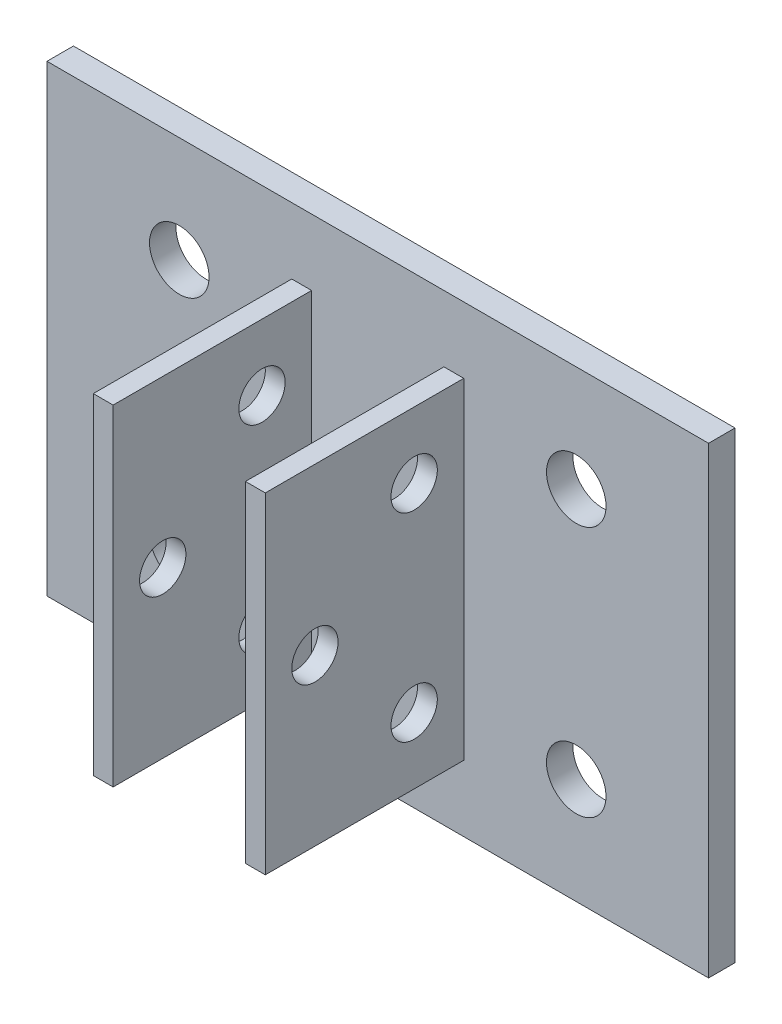
ISO-10303-21;
HEADER;
FILE_DESCRIPTION(('STEP AP214'),'2;1');
FILE_NAME('part.step','',(''),(''),'','','');
FILE_SCHEMA(('AUTOMOTIVE_DESIGN { 1 0 10303 214 1 1 1 1 }'));
ENDSEC;
DATA;
#1=APPLICATION_CONTEXT('core data for automotive mechanical design processes');
#2=APPLICATION_PROTOCOL_DEFINITION('international standard','automotive_design',2000,#1);
#3=PRODUCT_CONTEXT('',#1,'mechanical');
#4=PRODUCT('Part','Part','',(#3));
#5=PRODUCT_RELATED_PRODUCT_CATEGORY('part','',(#4));
#6=PRODUCT_DEFINITION_FORMATION('','',#4);
#7=PRODUCT_DEFINITION_CONTEXT('part definition',#1,'design');
#8=PRODUCT_DEFINITION('design','',#6,#7);
#9=PRODUCT_DEFINITION_SHAPE('','',#8);
#10=(LENGTH_UNIT() NAMED_UNIT(*) SI_UNIT(.MILLI.,.METRE.));
#11=(NAMED_UNIT(*) PLANE_ANGLE_UNIT() SI_UNIT($,.RADIAN.));
#12=(NAMED_UNIT(*) SI_UNIT($,.STERADIAN.) SOLID_ANGLE_UNIT());
#13=UNCERTAINTY_MEASURE_WITH_UNIT(LENGTH_MEASURE(1.E-05),#10,'distance_accuracy_value','');
#14=(GEOMETRIC_REPRESENTATION_CONTEXT(3) GLOBAL_UNCERTAINTY_ASSIGNED_CONTEXT((#13)) GLOBAL_UNIT_ASSIGNED_CONTEXT((#10,
#11,#12)) REPRESENTATION_CONTEXT('',''));
#15=CARTESIAN_POINT('',(0.,0.,0.));
#16=DIRECTION('',(0.,0.,1.));
#17=DIRECTION('',(1.,0.,0.));
#18=AXIS2_PLACEMENT_3D('',#15,#16,#17);
#19=CARTESIAN_POINT('',(0.,0.,2.));
#20=DIRECTION('',(0.,0.,-1.));
#21=DIRECTION('',(-1.,0.,0.));
#22=AXIS2_PLACEMENT_3D('',#19,#20,#21);
#23=PLANE('',#22);
#24=CARTESIAN_POINT('',(15.,-9.5,2.));
#25=DIRECTION('',(0.,0.,1.));
#26=DIRECTION('',(-1.,0.,0.));
#27=AXIS2_PLACEMENT_3D('',#24,#25,#26);
#28=CIRCLE('',#27,2.25);
#29=CARTESIAN_POINT('',(12.75,-9.5,2.));
#30=VERTEX_POINT('',#29);
#31=EDGE_CURVE('E188',#30,#30,#28,.T.);
#32=ORIENTED_EDGE('',*,*,#31,.F.);
#33=EDGE_LOOP('',(#32));
#34=FACE_BOUND('',#33,.T.);
#35=CARTESIAN_POINT('',(-15.,-9.5,2.));
#36=DIRECTION('',(0.,0.,1.));
#37=DIRECTION('',(1.,0.,0.));
#38=AXIS2_PLACEMENT_3D('',#35,#36,#37);
#39=CIRCLE('',#38,2.25);
#40=CARTESIAN_POINT('',(-12.75,-9.5,2.));
#41=VERTEX_POINT('',#40);
#42=EDGE_CURVE('E194',#41,#41,#39,.T.);
#43=ORIENTED_EDGE('',*,*,#42,.F.);
#44=EDGE_LOOP('',(#43));
#45=FACE_BOUND('',#44,.T.);
#46=CARTESIAN_POINT('',(-15.,9.5,2.));
#47=DIRECTION('',(0.,0.,1.));
#48=DIRECTION('',(-1.,0.,0.));
#49=AXIS2_PLACEMENT_3D('',#46,#47,#48);
#50=CIRCLE('',#49,2.25);
#51=CARTESIAN_POINT('',(-17.25,9.5,2.));
#52=VERTEX_POINT('',#51);
#53=EDGE_CURVE('E200',#52,#52,#50,.T.);
#54=ORIENTED_EDGE('',*,*,#53,.F.);
#55=EDGE_LOOP('',(#54));
#56=FACE_BOUND('',#55,.T.);
#57=CARTESIAN_POINT('',(15.,9.5,2.));
#58=DIRECTION('',(0.,0.,1.));
#59=DIRECTION('',(1.,0.,0.));
#60=AXIS2_PLACEMENT_3D('',#57,#58,#59);
#61=CIRCLE('',#60,2.25);
#62=CARTESIAN_POINT('',(17.25,9.5,2.));
#63=VERTEX_POINT('',#62);
#64=EDGE_CURVE('E206',#63,#63,#61,.T.);
#65=ORIENTED_EDGE('',*,*,#64,.F.);
#66=EDGE_LOOP('',(#65));
#67=FACE_BOUND('',#66,.T.);
#68=DIRECTION('',(0.,1.,0.));
#69=VECTOR('',#68,1.);
#70=CARTESIAN_POINT('',(25.,-17.5,2.));
#71=LINE('',#70,#69);
#72=CARTESIAN_POINT('',(25.,-17.5,2.));
#73=VERTEX_POINT('',#72);
#74=CARTESIAN_POINT('',(25.,17.5,2.));
#75=VERTEX_POINT('',#74);
#76=EDGE_CURVE('E212',#73,#75,#71,.T.);
#77=ORIENTED_EDGE('',*,*,#76,.T.);
#78=DIRECTION('',(-1.,0.,0.));
#79=VECTOR('',#78,1.);
#80=CARTESIAN_POINT('',(-25.,17.5,2.));
#81=LINE('',#80,#79);
#82=CARTESIAN_POINT('',(-25.,17.5,2.));
#83=VERTEX_POINT('',#82);
#84=EDGE_CURVE('E215',#75,#83,#81,.T.);
#85=ORIENTED_EDGE('',*,*,#84,.T.);
#86=DIRECTION('',(0.,-1.,0.));
#87=VECTOR('',#86,1.);
#88=CARTESIAN_POINT('',(-25.,-17.5,2.));
#89=LINE('',#88,#87);
#90=CARTESIAN_POINT('',(-25.,-17.5,2.));
#91=VERTEX_POINT('',#90);
#92=EDGE_CURVE('E218',#83,#91,#89,.T.);
#93=ORIENTED_EDGE('',*,*,#92,.T.);
#94=DIRECTION('',(1.,0.,0.));
#95=VECTOR('',#94,1.);
#96=CARTESIAN_POINT('',(-25.,-17.5,2.));
#97=LINE('',#96,#95);
#98=EDGE_CURVE('E220',#91,#73,#97,.T.);
#99=ORIENTED_EDGE('',*,*,#98,.T.);
#100=EDGE_LOOP('',(#77,#85,#93,#99));
#101=FACE_BOUND('',#100,.T.);
#102=DIRECTION('',(1.,0.,0.));
#103=VECTOR('',#102,1.);
#104=CARTESIAN_POINT('',(0.,12.5,2.));
#105=LINE('',#104,#103);
#106=CARTESIAN_POINT('',(-6.5,12.5,2.));
#107=VERTEX_POINT('',#106);
#108=CARTESIAN_POINT('',(-5.,12.5,2.));
#109=VERTEX_POINT('',#108);
#110=EDGE_CURVE('E152',#107,#109,#105,.T.);
#111=ORIENTED_EDGE('',*,*,#110,.T.);
#112=DIRECTION('',(0.,-1.,0.));
#113=VECTOR('',#112,1.);
#114=CARTESIAN_POINT('',(-5.,0.,2.));
#115=LINE('',#114,#113);
#116=CARTESIAN_POINT('',(-5.,-12.5,2.));
#117=VERTEX_POINT('',#116);
#118=EDGE_CURVE('E150',#109,#117,#115,.T.);
#119=ORIENTED_EDGE('',*,*,#118,.T.);
#120=DIRECTION('',(1.,0.,0.));
#121=VECTOR('',#120,1.);
#122=CARTESIAN_POINT('',(0.,-12.5,2.));
#123=LINE('',#122,#121);
#124=CARTESIAN_POINT('',(-6.5,-12.5,2.));
#125=VERTEX_POINT('',#124);
#126=EDGE_CURVE('E162',#125,#117,#123,.T.);
#127=ORIENTED_EDGE('',*,*,#126,.F.);
#128=DIRECTION('',(0.,1.,0.));
#129=VECTOR('',#128,1.);
#130=CARTESIAN_POINT('',(-6.5,0.,2.));
#131=LINE('',#130,#129);
#132=EDGE_CURVE('E172',#125,#107,#131,.T.);
#133=ORIENTED_EDGE('',*,*,#132,.T.);
#134=EDGE_LOOP('',(#111,#119,#127,#133));
#135=FACE_BOUND('',#134,.T.);
#136=DIRECTION('',(1.,0.,0.));
#137=VECTOR('',#136,1.);
#138=CARTESIAN_POINT('',(0.,-12.5,2.));
#139=LINE('',#138,#137);
#140=CARTESIAN_POINT('',(5.,-12.5,2.));
#141=VERTEX_POINT('',#140);
#142=CARTESIAN_POINT('',(6.5,-12.5,2.));
#143=VERTEX_POINT('',#142);
#144=EDGE_CURVE('E149',#141,#143,#139,.T.);
#145=ORIENTED_EDGE('',*,*,#144,.F.);
#146=DIRECTION('',(0.,-1.,0.));
#147=VECTOR('',#146,1.);
#148=CARTESIAN_POINT('',(5.,0.,2.));
#149=LINE('',#148,#147);
#150=CARTESIAN_POINT('',(5.,12.5,2.));
#151=VERTEX_POINT('',#150);
#152=EDGE_CURVE('E146',#151,#141,#149,.T.);
#153=ORIENTED_EDGE('',*,*,#152,.F.);
#154=DIRECTION('',(1.,0.,0.));
#155=VECTOR('',#154,1.);
#156=CARTESIAN_POINT('',(0.,12.5,2.));
#157=LINE('',#156,#155);
#158=CARTESIAN_POINT('',(6.5,12.5,2.));
#159=VERTEX_POINT('',#158);
#160=EDGE_CURVE('E59',#151,#159,#157,.T.);
#161=ORIENTED_EDGE('',*,*,#160,.T.);
#162=DIRECTION('',(0.,1.,0.));
#163=VECTOR('',#162,1.);
#164=CARTESIAN_POINT('',(6.5,0.,2.));
#165=LINE('',#164,#163);
#166=EDGE_CURVE('E54',#143,#159,#165,.T.);
#167=ORIENTED_EDGE('',*,*,#166,.F.);
#168=EDGE_LOOP('',(#145,#153,#161,#167));
#169=FACE_BOUND('',#168,.T.);
#170=ADVANCED_FACE('F37',(#34,#45,#56,#67,#101,#135,#169),#23,.F.);
#171=CARTESIAN_POINT('',(0.,0.,0.));
#172=DIRECTION('',(0.,0.,-1.));
#173=DIRECTION('',(-1.,0.,0.));
#174=AXIS2_PLACEMENT_3D('',#171,#172,#173);
#175=PLANE('',#174);
#176=CARTESIAN_POINT('',(-15.,-9.5,0.));
#177=DIRECTION('',(0.,0.,1.));
#178=DIRECTION('',(1.,0.,0.));
#179=AXIS2_PLACEMENT_3D('',#176,#177,#178);
#180=CIRCLE('',#179,2.25);
#181=CARTESIAN_POINT('',(-12.75,-9.5,0.));
#182=VERTEX_POINT('',#181);
#183=EDGE_CURVE('E191',#182,#182,#180,.T.);
#184=ORIENTED_EDGE('',*,*,#183,.T.);
#185=EDGE_LOOP('',(#184));
#186=FACE_BOUND('',#185,.T.);
#187=CARTESIAN_POINT('',(15.,9.5,0.));
#188=DIRECTION('',(0.,0.,1.));
#189=DIRECTION('',(1.,0.,0.));
#190=AXIS2_PLACEMENT_3D('',#187,#188,#189);
#191=CIRCLE('',#190,2.25);
#192=CARTESIAN_POINT('',(17.25,9.5,0.));
#193=VERTEX_POINT('',#192);
#194=EDGE_CURVE('E203',#193,#193,#191,.T.);
#195=ORIENTED_EDGE('',*,*,#194,.T.);
#196=EDGE_LOOP('',(#195));
#197=FACE_BOUND('',#196,.T.);
#198=DIRECTION('',(0.,1.,0.));
#199=VECTOR('',#198,1.);
#200=CARTESIAN_POINT('',(25.,-17.5,0.));
#201=LINE('',#200,#199);
#202=CARTESIAN_POINT('',(25.,-17.5,0.));
#203=VERTEX_POINT('',#202);
#204=CARTESIAN_POINT('',(25.,17.5,0.));
#205=VERTEX_POINT('',#204);
#206=EDGE_CURVE('E209',#203,#205,#201,.T.);
#207=ORIENTED_EDGE('',*,*,#206,.F.);
#208=DIRECTION('',(1.,0.,0.));
#209=VECTOR('',#208,1.);
#210=CARTESIAN_POINT('',(-25.,-17.5,0.));
#211=LINE('',#210,#209);
#212=CARTESIAN_POINT('',(-25.,-17.5,0.));
#213=VERTEX_POINT('',#212);
#214=EDGE_CURVE('E216',#213,#203,#211,.T.);
#215=ORIENTED_EDGE('',*,*,#214,.F.);
#216=DIRECTION('',(0.,-1.,0.));
#217=VECTOR('',#216,1.);
#218=CARTESIAN_POINT('',(-25.,-17.5,0.));
#219=LINE('',#218,#217);
#220=CARTESIAN_POINT('',(-25.,17.5,0.));
#221=VERTEX_POINT('',#220);
#222=EDGE_CURVE('E227',#221,#213,#219,.T.);
#223=ORIENTED_EDGE('',*,*,#222,.F.);
#224=DIRECTION('',(-1.,0.,0.));
#225=VECTOR('',#224,1.);
#226=CARTESIAN_POINT('',(-25.,17.5,0.));
#227=LINE('',#226,#225);
#228=EDGE_CURVE('E225',#205,#221,#227,.T.);
#229=ORIENTED_EDGE('',*,*,#228,.F.);
#230=EDGE_LOOP('',(#207,#215,#223,#229));
#231=FACE_BOUND('',#230,.T.);
#232=CARTESIAN_POINT('',(-15.,9.5,0.));
#233=DIRECTION('',(0.,0.,1.));
#234=DIRECTION('',(-1.,0.,0.));
#235=AXIS2_PLACEMENT_3D('',#232,#233,#234);
#236=CIRCLE('',#235,2.25);
#237=CARTESIAN_POINT('',(-17.25,9.5,0.));
#238=VERTEX_POINT('',#237);
#239=EDGE_CURVE('E197',#238,#238,#236,.T.);
#240=ORIENTED_EDGE('',*,*,#239,.T.);
#241=EDGE_LOOP('',(#240));
#242=FACE_BOUND('',#241,.T.);
#243=CARTESIAN_POINT('',(15.,-9.5,0.));
#244=DIRECTION('',(0.,0.,1.));
#245=DIRECTION('',(-1.,0.,0.));
#246=AXIS2_PLACEMENT_3D('',#243,#244,#245);
#247=CIRCLE('',#246,2.25);
#248=CARTESIAN_POINT('',(12.75,-9.5,0.));
#249=VERTEX_POINT('',#248);
#250=EDGE_CURVE('E187',#249,#249,#247,.T.);
#251=ORIENTED_EDGE('',*,*,#250,.T.);
#252=EDGE_LOOP('',(#251));
#253=FACE_BOUND('',#252,.T.);
#254=ADVANCED_FACE('F290',(#186,#197,#231,#242,#253),#175,.T.);
#255=CARTESIAN_POINT('',(25.,-17.5,2.));
#256=DIRECTION('',(-1.,0.,0.));
#257=DIRECTION('',(0.,0.,1.));
#258=AXIS2_PLACEMENT_3D('',#255,#256,#257);
#259=PLANE('',#258);
#260=ORIENTED_EDGE('',*,*,#206,.T.);
#261=DIRECTION('',(0.,0.,-1.));
#262=VECTOR('',#261,1.);
#263=CARTESIAN_POINT('',(25.,17.5,2.));
#264=LINE('',#263,#262);
#265=EDGE_CURVE('E11',#75,#205,#264,.T.);
#266=ORIENTED_EDGE('',*,*,#265,.F.);
#267=ORIENTED_EDGE('',*,*,#76,.F.);
#268=DIRECTION('',(0.,0.,-1.));
#269=VECTOR('',#268,1.);
#270=CARTESIAN_POINT('',(25.,-17.5,2.));
#271=LINE('',#270,#269);
#272=EDGE_CURVE('E222',#73,#203,#271,.T.);
#273=ORIENTED_EDGE('',*,*,#272,.T.);
#274=EDGE_LOOP('',(#260,#266,#267,#273));
#275=FACE_BOUND('',#274,.T.);
#276=ADVANCED_FACE('F39',(#275),#259,.F.);
#277=CARTESIAN_POINT('',(-25.,17.5,2.));
#278=DIRECTION('',(0.,-1.,0.));
#279=DIRECTION('',(0.,0.,-1.));
#280=AXIS2_PLACEMENT_3D('',#277,#278,#279);
#281=PLANE('',#280);
#282=ORIENTED_EDGE('',*,*,#228,.T.);
#283=DIRECTION('',(0.,0.,-1.));
#284=VECTOR('',#283,1.);
#285=CARTESIAN_POINT('',(-25.,17.5,2.));
#286=LINE('',#285,#284);
#287=EDGE_CURVE('E46',#83,#221,#286,.T.);
#288=ORIENTED_EDGE('',*,*,#287,.F.);
#289=ORIENTED_EDGE('',*,*,#84,.F.);
#290=ORIENTED_EDGE('',*,*,#265,.T.);
#291=EDGE_LOOP('',(#282,#288,#289,#290));
#292=FACE_BOUND('',#291,.T.);
#293=ADVANCED_FACE('F310',(#292),#281,.F.);
#294=CARTESIAN_POINT('',(-25.,-17.5,2.));
#295=DIRECTION('',(1.,0.,0.));
#296=DIRECTION('',(0.,0.,-1.));
#297=AXIS2_PLACEMENT_3D('',#294,#295,#296);
#298=PLANE('',#297);
#299=ORIENTED_EDGE('',*,*,#222,.T.);
#300=DIRECTION('',(0.,0.,-1.));
#301=VECTOR('',#300,1.);
#302=CARTESIAN_POINT('',(-25.,-17.5,2.));
#303=LINE('',#302,#301);
#304=EDGE_CURVE('E232',#91,#213,#303,.T.);
#305=ORIENTED_EDGE('',*,*,#304,.F.);
#306=ORIENTED_EDGE('',*,*,#92,.F.);
#307=ORIENTED_EDGE('',*,*,#287,.T.);
#308=EDGE_LOOP('',(#299,#305,#306,#307));
#309=FACE_BOUND('',#308,.T.);
#310=ADVANCED_FACE('F307',(#309),#298,.F.);
#311=CARTESIAN_POINT('',(-25.,-17.5,2.));
#312=DIRECTION('',(0.,1.,0.));
#313=DIRECTION('',(0.,0.,1.));
#314=AXIS2_PLACEMENT_3D('',#311,#312,#313);
#315=PLANE('',#314);
#316=ORIENTED_EDGE('',*,*,#214,.T.);
#317=ORIENTED_EDGE('',*,*,#272,.F.);
#318=ORIENTED_EDGE('',*,*,#98,.F.);
#319=ORIENTED_EDGE('',*,*,#304,.T.);
#320=EDGE_LOOP('',(#316,#317,#318,#319));
#321=FACE_BOUND('',#320,.T.);
#322=ADVANCED_FACE('F304',(#321),#315,.F.);
#323=CARTESIAN_POINT('',(15.,9.5,2.));
#324=DIRECTION('',(0.,0.,-1.));
#325=DIRECTION('',(-1.,0.,0.));
#326=AXIS2_PLACEMENT_3D('',#323,#324,#325);
#327=CYLINDRICAL_SURFACE('',#326,2.25);
#328=ORIENTED_EDGE('',*,*,#64,.T.);
#329=EDGE_LOOP('',(#328));
#330=FACE_BOUND('',#329,.T.);
#331=ORIENTED_EDGE('',*,*,#194,.F.);
#332=EDGE_LOOP('',(#331));
#333=FACE_BOUND('',#332,.T.);
#334=ADVANCED_FACE('F301',(#330,#333),#327,.F.);
#335=CARTESIAN_POINT('',(-15.,9.5,2.));
#336=DIRECTION('',(0.,0.,-1.));
#337=DIRECTION('',(-1.,0.,0.));
#338=AXIS2_PLACEMENT_3D('',#335,#336,#337);
#339=CYLINDRICAL_SURFACE('',#338,2.25);
#340=ORIENTED_EDGE('',*,*,#53,.T.);
#341=EDGE_LOOP('',(#340));
#342=FACE_BOUND('',#341,.T.);
#343=ORIENTED_EDGE('',*,*,#239,.F.);
#344=EDGE_LOOP('',(#343));
#345=FACE_BOUND('',#344,.T.);
#346=ADVANCED_FACE('F373',(#342,#345),#339,.F.);
#347=CARTESIAN_POINT('',(-15.,-9.5,2.));
#348=DIRECTION('',(0.,0.,-1.));
#349=DIRECTION('',(-1.,0.,0.));
#350=AXIS2_PLACEMENT_3D('',#347,#348,#349);
#351=CYLINDRICAL_SURFACE('',#350,2.25);
#352=ORIENTED_EDGE('',*,*,#42,.T.);
#353=EDGE_LOOP('',(#352));
#354=FACE_BOUND('',#353,.T.);
#355=ORIENTED_EDGE('',*,*,#183,.F.);
#356=EDGE_LOOP('',(#355));
#357=FACE_BOUND('',#356,.T.);
#358=ADVANCED_FACE('F370',(#354,#357),#351,.F.);
#359=CARTESIAN_POINT('',(15.,-9.5,2.));
#360=DIRECTION('',(0.,0.,-1.));
#361=DIRECTION('',(-1.,0.,0.));
#362=AXIS2_PLACEMENT_3D('',#359,#360,#361);
#363=CYLINDRICAL_SURFACE('',#362,2.25);
#364=ORIENTED_EDGE('',*,*,#31,.T.);
#365=EDGE_LOOP('',(#364));
#366=FACE_BOUND('',#365,.T.);
#367=ORIENTED_EDGE('',*,*,#250,.F.);
#368=EDGE_LOOP('',(#367));
#369=FACE_BOUND('',#368,.T.);
#370=ADVANCED_FACE('F366',(#366,#369),#363,.F.);
#371=CARTESIAN_POINT('',(-5.,0.,17.));
#372=DIRECTION('',(1.,0.,0.));
#373=DIRECTION('',(0.,1.,0.));
#374=AXIS2_PLACEMENT_3D('',#371,#372,#373);
#375=PLANE('',#374);
#376=CARTESIAN_POINT('',(-5.,-7.5,5.75));
#377=DIRECTION('',(1.,0.,0.));
#378=DIRECTION('',(0.,1.,0.));
#379=AXIS2_PLACEMENT_3D('',#376,#377,#378);
#380=CIRCLE('',#379,1.75);
#381=CARTESIAN_POINT('',(-5.,-5.75,5.75));
#382=VERTEX_POINT('',#381);
#383=EDGE_CURVE('E263',#382,#382,#380,.T.);
#384=ORIENTED_EDGE('',*,*,#383,.F.);
#385=EDGE_LOOP('',(#384));
#386=FACE_BOUND('',#385,.T.);
#387=CARTESIAN_POINT('',(-5.,7.5,5.75));
#388=DIRECTION('',(1.,0.,0.));
#389=DIRECTION('',(0.,1.,0.));
#390=AXIS2_PLACEMENT_3D('',#387,#388,#389);
#391=CIRCLE('',#390,1.75);
#392=CARTESIAN_POINT('',(-5.,9.25,5.75));
#393=VERTEX_POINT('',#392);
#394=EDGE_CURVE('E248',#393,#393,#391,.T.);
#395=ORIENTED_EDGE('',*,*,#394,.F.);
#396=EDGE_LOOP('',(#395));
#397=FACE_BOUND('',#396,.T.);
#398=CARTESIAN_POINT('',(-5.,0.,13.25));
#399=DIRECTION('',(1.,0.,0.));
#400=DIRECTION('',(0.,1.,0.));
#401=AXIS2_PLACEMENT_3D('',#398,#399,#400);
#402=CIRCLE('',#401,1.75);
#403=CARTESIAN_POINT('',(-5.,1.75,13.25));
#404=VERTEX_POINT('',#403);
#405=EDGE_CURVE('E244',#404,#404,#402,.T.);
#406=ORIENTED_EDGE('',*,*,#405,.F.);
#407=EDGE_LOOP('',(#406));
#408=FACE_BOUND('',#407,.T.);
#409=ORIENTED_EDGE('',*,*,#118,.F.);
#410=DIRECTION('',(0.,0.,-1.));
#411=VECTOR('',#410,1.);
#412=CARTESIAN_POINT('',(-5.,12.5,17.));
#413=LINE('',#412,#411);
#414=CARTESIAN_POINT('',(-5.,12.5,17.));
#415=VERTEX_POINT('',#414);
#416=EDGE_CURVE('E184',#415,#109,#413,.T.);
#417=ORIENTED_EDGE('',*,*,#416,.F.);
#418=DIRECTION('',(0.,-1.,0.));
#419=VECTOR('',#418,1.);
#420=CARTESIAN_POINT('',(-5.,0.,17.));
#421=LINE('',#420,#419);
#422=CARTESIAN_POINT('',(-5.,-12.5,17.));
#423=VERTEX_POINT('',#422);
#424=EDGE_CURVE('E158',#415,#423,#421,.T.);
#425=ORIENTED_EDGE('',*,*,#424,.T.);
#426=DIRECTION('',(0.,0.,-1.));
#427=VECTOR('',#426,1.);
#428=CARTESIAN_POINT('',(-5.,-12.5,17.));
#429=LINE('',#428,#427);
#430=EDGE_CURVE('E169',#423,#117,#429,.T.);
#431=ORIENTED_EDGE('',*,*,#430,.T.);
#432=EDGE_LOOP('',(#409,#417,#425,#431));
#433=FACE_BOUND('',#432,.T.);
#434=ADVANCED_FACE('F340',(#386,#397,#408,#433),#375,.T.);
#435=CARTESIAN_POINT('',(0.,12.5,17.));
#436=DIRECTION('',(0.,1.,0.));
#437=DIRECTION('',(0.,0.,1.));
#438=AXIS2_PLACEMENT_3D('',#435,#436,#437);
#439=PLANE('',#438);
#440=ORIENTED_EDGE('',*,*,#110,.F.);
#441=DIRECTION('',(0.,0.,-1.));
#442=VECTOR('',#441,1.);
#443=CARTESIAN_POINT('',(-6.5,12.5,17.));
#444=LINE('',#443,#442);
#445=CARTESIAN_POINT('',(-6.5,12.5,17.));
#446=VERTEX_POINT('',#445);
#447=EDGE_CURVE('E181',#446,#107,#444,.T.);
#448=ORIENTED_EDGE('',*,*,#447,.F.);
#449=DIRECTION('',(1.,0.,0.));
#450=VECTOR('',#449,1.);
#451=CARTESIAN_POINT('',(0.,12.5,17.));
#452=LINE('',#451,#450);
#453=EDGE_CURVE('E161',#446,#415,#452,.T.);
#454=ORIENTED_EDGE('',*,*,#453,.T.);
#455=ORIENTED_EDGE('',*,*,#416,.T.);
#456=EDGE_LOOP('',(#440,#448,#454,#455));
#457=FACE_BOUND('',#456,.T.);
#458=ADVANCED_FACE('F336',(#457),#439,.T.);
#459=CARTESIAN_POINT('',(-6.5,0.,17.));
#460=DIRECTION('',(-1.,0.,0.));
#461=DIRECTION('',(0.,0.,1.));
#462=AXIS2_PLACEMENT_3D('',#459,#460,#461);
#463=PLANE('',#462);
#464=CARTESIAN_POINT('',(-6.5,-7.5,5.75));
#465=DIRECTION('',(-1.,0.,0.));
#466=DIRECTION('',(0.,0.,1.));
#467=AXIS2_PLACEMENT_3D('',#464,#465,#466);
#468=CIRCLE('',#467,1.75);
#469=CARTESIAN_POINT('',(-6.5,-7.5,7.5));
#470=VERTEX_POINT('',#469);
#471=EDGE_CURVE('E240',#470,#470,#468,.T.);
#472=ORIENTED_EDGE('',*,*,#471,.F.);
#473=EDGE_LOOP('',(#472));
#474=FACE_BOUND('',#473,.T.);
#475=CARTESIAN_POINT('',(-6.5,7.5,5.75));
#476=DIRECTION('',(-1.,0.,0.));
#477=DIRECTION('',(0.,0.,1.));
#478=AXIS2_PLACEMENT_3D('',#475,#476,#477);
#479=CIRCLE('',#478,1.75);
#480=CARTESIAN_POINT('',(-6.5,7.5,7.5));
#481=VERTEX_POINT('',#480);
#482=EDGE_CURVE('E565',#481,#481,#479,.T.);
#483=ORIENTED_EDGE('',*,*,#482,.F.);
#484=EDGE_LOOP('',(#483));
#485=FACE_BOUND('',#484,.T.);
#486=CARTESIAN_POINT('',(-6.5,0.,13.25));
#487=DIRECTION('',(-1.,0.,0.));
#488=DIRECTION('',(0.,0.,1.));
#489=AXIS2_PLACEMENT_3D('',#486,#487,#488);
#490=CIRCLE('',#489,1.75);
#491=CARTESIAN_POINT('',(-6.5,0.,15.));
#492=VERTEX_POINT('',#491);
#493=EDGE_CURVE('E568',#492,#492,#490,.T.);
#494=ORIENTED_EDGE('',*,*,#493,.F.);
#495=EDGE_LOOP('',(#494));
#496=FACE_BOUND('',#495,.T.);
#497=ORIENTED_EDGE('',*,*,#132,.F.);
#498=DIRECTION('',(0.,0.,-1.));
#499=VECTOR('',#498,1.);
#500=CARTESIAN_POINT('',(-6.5,-12.5,17.));
#501=LINE('',#500,#499);
#502=CARTESIAN_POINT('',(-6.5,-12.5,17.));
#503=VERTEX_POINT('',#502);
#504=EDGE_CURVE('E178',#503,#125,#501,.T.);
#505=ORIENTED_EDGE('',*,*,#504,.F.);
#506=DIRECTION('',(0.,1.,0.));
#507=VECTOR('',#506,1.);
#508=CARTESIAN_POINT('',(-6.5,0.,17.));
#509=LINE('',#508,#507);
#510=EDGE_CURVE('E165',#503,#446,#509,.T.);
#511=ORIENTED_EDGE('',*,*,#510,.T.);
#512=ORIENTED_EDGE('',*,*,#447,.T.);
#513=EDGE_LOOP('',(#497,#505,#511,#512));
#514=FACE_BOUND('',#513,.T.);
#515=ADVANCED_FACE('F347',(#474,#485,#496,#514),#463,.T.);
#516=CARTESIAN_POINT('',(0.,-12.5,17.));
#517=DIRECTION('',(0.,1.,0.));
#518=DIRECTION('',(0.,0.,1.));
#519=AXIS2_PLACEMENT_3D('',#516,#517,#518);
#520=PLANE('',#519);
#521=ORIENTED_EDGE('',*,*,#126,.T.);
#522=ORIENTED_EDGE('',*,*,#430,.F.);
#523=DIRECTION('',(1.,0.,0.));
#524=VECTOR('',#523,1.);
#525=CARTESIAN_POINT('',(0.,-12.5,17.));
#526=LINE('',#525,#524);
#527=EDGE_CURVE('E168',#503,#423,#526,.T.);
#528=ORIENTED_EDGE('',*,*,#527,.F.);
#529=ORIENTED_EDGE('',*,*,#504,.T.);
#530=EDGE_LOOP('',(#521,#522,#528,#529));
#531=FACE_BOUND('',#530,.T.);
#532=ADVANCED_FACE('F344',(#531),#520,.F.);
#533=CARTESIAN_POINT('',(0.,0.,17.));
#534=DIRECTION('',(0.,0.,1.));
#535=DIRECTION('',(1.,0.,0.));
#536=AXIS2_PLACEMENT_3D('',#533,#534,#535);
#537=PLANE('',#536);
#538=ORIENTED_EDGE('',*,*,#424,.F.);
#539=ORIENTED_EDGE('',*,*,#453,.F.);
#540=ORIENTED_EDGE('',*,*,#510,.F.);
#541=ORIENTED_EDGE('',*,*,#527,.T.);
#542=EDGE_LOOP('',(#538,#539,#540,#541));
#543=FACE_BOUND('',#542,.T.);
#544=ADVANCED_FACE('F349',(#543),#537,.T.);
#545=CARTESIAN_POINT('',(0.,-12.5,17.));
#546=DIRECTION('',(0.,1.,0.));
#547=DIRECTION('',(0.,0.,1.));
#548=AXIS2_PLACEMENT_3D('',#545,#546,#547);
#549=PLANE('',#548);
#550=ORIENTED_EDGE('',*,*,#144,.T.);
#551=DIRECTION('',(0.,0.,-1.));
#552=VECTOR('',#551,1.);
#553=CARTESIAN_POINT('',(6.5,-12.5,17.));
#554=LINE('',#553,#552);
#555=CARTESIAN_POINT('',(6.5,-12.5,17.));
#556=VERTEX_POINT('',#555);
#557=EDGE_CURVE('E130',#556,#143,#554,.T.);
#558=ORIENTED_EDGE('',*,*,#557,.F.);
#559=DIRECTION('',(1.,0.,0.));
#560=VECTOR('',#559,1.);
#561=CARTESIAN_POINT('',(0.,-12.5,17.));
#562=LINE('',#561,#560);
#563=CARTESIAN_POINT('',(5.,-12.5,17.));
#564=VERTEX_POINT('',#563);
#565=EDGE_CURVE('E137',#564,#556,#562,.T.);
#566=ORIENTED_EDGE('',*,*,#565,.F.);
#567=DIRECTION('',(0.,0.,-1.));
#568=VECTOR('',#567,1.);
#569=CARTESIAN_POINT('',(5.,-12.5,17.));
#570=LINE('',#569,#568);
#571=EDGE_CURVE('E268',#564,#141,#570,.T.);
#572=ORIENTED_EDGE('',*,*,#571,.T.);
#573=EDGE_LOOP('',(#550,#558,#566,#572));
#574=FACE_BOUND('',#573,.T.);
#575=ADVANCED_FACE('F148',(#574),#549,.F.);
#576=CARTESIAN_POINT('',(6.5,0.,17.));
#577=DIRECTION('',(-1.,0.,0.));
#578=DIRECTION('',(0.,0.,1.));
#579=AXIS2_PLACEMENT_3D('',#576,#577,#578);
#580=PLANE('',#579);
#581=CARTESIAN_POINT('',(6.5,-7.5,5.75));
#582=DIRECTION('',(-1.,0.,0.));
#583=DIRECTION('',(0.,0.,1.));
#584=AXIS2_PLACEMENT_3D('',#581,#582,#583);
#585=CIRCLE('',#584,1.75);
#586=CARTESIAN_POINT('',(6.5,-7.5,7.5));
#587=VERTEX_POINT('',#586);
#588=EDGE_CURVE('E260',#587,#587,#585,.T.);
#589=ORIENTED_EDGE('',*,*,#588,.T.);
#590=EDGE_LOOP('',(#589));
#591=FACE_BOUND('',#590,.T.);
#592=CARTESIAN_POINT('',(6.5,7.5,5.75));
#593=DIRECTION('',(-1.,0.,0.));
#594=DIRECTION('',(0.,0.,1.));
#595=AXIS2_PLACEMENT_3D('',#592,#593,#594);
#596=CIRCLE('',#595,1.75);
#597=CARTESIAN_POINT('',(6.5,7.5,7.5));
#598=VERTEX_POINT('',#597);
#599=EDGE_CURVE('E243',#598,#598,#596,.T.);
#600=ORIENTED_EDGE('',*,*,#599,.T.);
#601=EDGE_LOOP('',(#600));
#602=FACE_BOUND('',#601,.T.);
#603=CARTESIAN_POINT('',(6.5,0.,13.25));
#604=DIRECTION('',(-1.,0.,0.));
#605=DIRECTION('',(0.,0.,1.));
#606=AXIS2_PLACEMENT_3D('',#603,#604,#605);
#607=CIRCLE('',#606,1.75);
#608=CARTESIAN_POINT('',(6.5,0.,15.));
#609=VERTEX_POINT('',#608);
#610=EDGE_CURVE('E239',#609,#609,#607,.T.);
#611=ORIENTED_EDGE('',*,*,#610,.T.);
#612=EDGE_LOOP('',(#611));
#613=FACE_BOUND('',#612,.T.);
#614=ORIENTED_EDGE('',*,*,#166,.T.);
#615=DIRECTION('',(0.,0.,-1.));
#616=VECTOR('',#615,1.);
#617=CARTESIAN_POINT('',(6.5,12.5,17.));
#618=LINE('',#617,#616);
#619=CARTESIAN_POINT('',(6.5,12.5,17.));
#620=VERTEX_POINT('',#619);
#621=EDGE_CURVE('E132',#620,#159,#618,.T.);
#622=ORIENTED_EDGE('',*,*,#621,.F.);
#623=DIRECTION('',(0.,1.,0.));
#624=VECTOR('',#623,1.);
#625=CARTESIAN_POINT('',(6.5,0.,17.));
#626=LINE('',#625,#624);
#627=EDGE_CURVE('E126',#556,#620,#626,.T.);
#628=ORIENTED_EDGE('',*,*,#627,.F.);
#629=ORIENTED_EDGE('',*,*,#557,.T.);
#630=EDGE_LOOP('',(#614,#622,#628,#629));
#631=FACE_BOUND('',#630,.T.);
#632=ADVANCED_FACE('F128',(#591,#602,#613,#631),#580,.F.);
#633=CARTESIAN_POINT('',(0.,12.5,17.));
#634=DIRECTION('',(0.,1.,0.));
#635=DIRECTION('',(0.,0.,1.));
#636=AXIS2_PLACEMENT_3D('',#633,#634,#635);
#637=PLANE('',#636);
#638=ORIENTED_EDGE('',*,*,#160,.F.);
#639=DIRECTION('',(0.,0.,-1.));
#640=VECTOR('',#639,1.);
#641=CARTESIAN_POINT('',(5.,12.5,17.));
#642=LINE('',#641,#640);
#643=CARTESIAN_POINT('',(5.,12.5,17.));
#644=VERTEX_POINT('',#643);
#645=EDGE_CURVE('E154',#644,#151,#642,.T.);
#646=ORIENTED_EDGE('',*,*,#645,.F.);
#647=DIRECTION('',(1.,0.,0.));
#648=VECTOR('',#647,1.);
#649=CARTESIAN_POINT('',(0.,12.5,17.));
#650=LINE('',#649,#648);
#651=EDGE_CURVE('E136',#644,#620,#650,.T.);
#652=ORIENTED_EDGE('',*,*,#651,.T.);
#653=ORIENTED_EDGE('',*,*,#621,.T.);
#654=EDGE_LOOP('',(#638,#646,#652,#653));
#655=FACE_BOUND('',#654,.T.);
#656=ADVANCED_FACE('F278',(#655),#637,.T.);
#657=CARTESIAN_POINT('',(5.,0.,17.));
#658=DIRECTION('',(1.,0.,0.));
#659=DIRECTION('',(0.,1.,0.));
#660=AXIS2_PLACEMENT_3D('',#657,#658,#659);
#661=PLANE('',#660);
#662=CARTESIAN_POINT('',(5.,-7.5,5.75));
#663=DIRECTION('',(1.,0.,0.));
#664=DIRECTION('',(0.,1.,0.));
#665=AXIS2_PLACEMENT_3D('',#662,#663,#664);
#666=CIRCLE('',#665,1.75);
#667=CARTESIAN_POINT('',(5.,-5.75,5.75));
#668=VERTEX_POINT('',#667);
#669=EDGE_CURVE('E41',#668,#668,#666,.T.);
#670=ORIENTED_EDGE('',*,*,#669,.T.);
#671=EDGE_LOOP('',(#670));
#672=FACE_BOUND('',#671,.T.);
#673=CARTESIAN_POINT('',(5.,7.5,5.75));
#674=DIRECTION('',(1.,0.,0.));
#675=DIRECTION('',(0.,1.,0.));
#676=AXIS2_PLACEMENT_3D('',#673,#674,#675);
#677=CIRCLE('',#676,1.75);
#678=CARTESIAN_POINT('',(5.,9.25,5.75));
#679=VERTEX_POINT('',#678);
#680=EDGE_CURVE('E241',#679,#679,#677,.T.);
#681=ORIENTED_EDGE('',*,*,#680,.T.);
#682=EDGE_LOOP('',(#681));
#683=FACE_BOUND('',#682,.T.);
#684=CARTESIAN_POINT('',(5.,0.,13.25));
#685=DIRECTION('',(1.,0.,0.));
#686=DIRECTION('',(0.,1.,0.));
#687=AXIS2_PLACEMENT_3D('',#684,#685,#686);
#688=CIRCLE('',#687,1.75);
#689=CARTESIAN_POINT('',(5.,1.75,13.25));
#690=VERTEX_POINT('',#689);
#691=EDGE_CURVE('E237',#690,#690,#688,.T.);
#692=ORIENTED_EDGE('',*,*,#691,.T.);
#693=EDGE_LOOP('',(#692));
#694=FACE_BOUND('',#693,.T.);
#695=ORIENTED_EDGE('',*,*,#152,.T.);
#696=ORIENTED_EDGE('',*,*,#571,.F.);
#697=DIRECTION('',(0.,-1.,0.));
#698=VECTOR('',#697,1.);
#699=CARTESIAN_POINT('',(5.,0.,17.));
#700=LINE('',#699,#698);
#701=EDGE_CURVE('E142',#644,#564,#700,.T.);
#702=ORIENTED_EDGE('',*,*,#701,.F.);
#703=ORIENTED_EDGE('',*,*,#645,.T.);
#704=EDGE_LOOP('',(#695,#696,#702,#703));
#705=FACE_BOUND('',#704,.T.);
#706=ADVANCED_FACE('F276',(#672,#683,#694,#705),#661,.F.);
#707=CARTESIAN_POINT('',(0.,0.,17.));
#708=DIRECTION('',(0.,0.,1.));
#709=DIRECTION('',(1.,0.,0.));
#710=AXIS2_PLACEMENT_3D('',#707,#708,#709);
#711=PLANE('',#710);
#712=ORIENTED_EDGE('',*,*,#565,.T.);
#713=ORIENTED_EDGE('',*,*,#627,.T.);
#714=ORIENTED_EDGE('',*,*,#651,.F.);
#715=ORIENTED_EDGE('',*,*,#701,.T.);
#716=EDGE_LOOP('',(#712,#713,#714,#715));
#717=FACE_BOUND('',#716,.T.);
#718=ADVANCED_FACE('F140',(#717),#711,.T.);
#719=CARTESIAN_POINT('',(25.,0.,13.25));
#720=DIRECTION('',(-1.,0.,0.));
#721=DIRECTION('',(0.,0.,1.));
#722=AXIS2_PLACEMENT_3D('',#719,#720,#721);
#723=CYLINDRICAL_SURFACE('',#722,1.75);
#724=ORIENTED_EDGE('',*,*,#691,.F.);
#725=EDGE_LOOP('',(#724));
#726=FACE_BOUND('',#725,.T.);
#727=ORIENTED_EDGE('',*,*,#610,.F.);
#728=EDGE_LOOP('',(#727));
#729=FACE_BOUND('',#728,.T.);
#730=ADVANCED_FACE('F503',(#726,#729),#723,.F.);
#731=CARTESIAN_POINT('',(25.,7.5,5.75));
#732=DIRECTION('',(-1.,0.,0.));
#733=DIRECTION('',(0.,0.,1.));
#734=AXIS2_PLACEMENT_3D('',#731,#732,#733);
#735=CYLINDRICAL_SURFACE('',#734,1.75);
#736=ORIENTED_EDGE('',*,*,#680,.F.);
#737=EDGE_LOOP('',(#736));
#738=FACE_BOUND('',#737,.T.);
#739=ORIENTED_EDGE('',*,*,#599,.F.);
#740=EDGE_LOOP('',(#739));
#741=FACE_BOUND('',#740,.T.);
#742=ADVANCED_FACE('F510',(#738,#741),#735,.F.);
#743=CARTESIAN_POINT('',(25.,-7.5,5.75));
#744=DIRECTION('',(-1.,0.,0.));
#745=DIRECTION('',(0.,0.,1.));
#746=AXIS2_PLACEMENT_3D('',#743,#744,#745);
#747=CYLINDRICAL_SURFACE('',#746,1.75);
#748=ORIENTED_EDGE('',*,*,#669,.F.);
#749=EDGE_LOOP('',(#748));
#750=FACE_BOUND('',#749,.T.);
#751=ORIENTED_EDGE('',*,*,#588,.F.);
#752=EDGE_LOOP('',(#751));
#753=FACE_BOUND('',#752,.T.);
#754=ADVANCED_FACE('F520',(#750,#753),#747,.F.);
#755=ORIENTED_EDGE('',*,*,#405,.T.);
#756=EDGE_LOOP('',(#755));
#757=FACE_BOUND('',#756,.T.);
#758=ORIENTED_EDGE('',*,*,#493,.T.);
#759=EDGE_LOOP('',(#758));
#760=FACE_BOUND('',#759,.T.);
#761=ADVANCED_FACE('F513',(#757,#760),#723,.F.);
#762=ORIENTED_EDGE('',*,*,#394,.T.);
#763=EDGE_LOOP('',(#762));
#764=FACE_BOUND('',#763,.T.);
#765=ORIENTED_EDGE('',*,*,#482,.T.);
#766=EDGE_LOOP('',(#765));
#767=FACE_BOUND('',#766,.T.);
#768=ADVANCED_FACE('F523',(#764,#767),#735,.F.);
#769=ORIENTED_EDGE('',*,*,#383,.T.);
#770=EDGE_LOOP('',(#769));
#771=FACE_BOUND('',#770,.T.);
#772=ORIENTED_EDGE('',*,*,#471,.T.);
#773=EDGE_LOOP('',(#772));
#774=FACE_BOUND('',#773,.T.);
#775=ADVANCED_FACE('F532',(#771,#774),#747,.F.);
#776=CLOSED_SHELL('',(#170,#254,#276,#293,#310,#322,#334,#346,#358,#370,#434,#458,#515,#532,
#544,#575,#632,#656,#706,#718,#730,#742,#754,#761,#768,#775));
#777=MANIFOLD_SOLID_BREP('B2',#776);
#778=ADVANCED_BREP_SHAPE_REPRESENTATION('',(#18,#777),#14);
#779=SHAPE_DEFINITION_REPRESENTATION(#9,#778);
ENDSEC;
END-ISO-10303-21;
